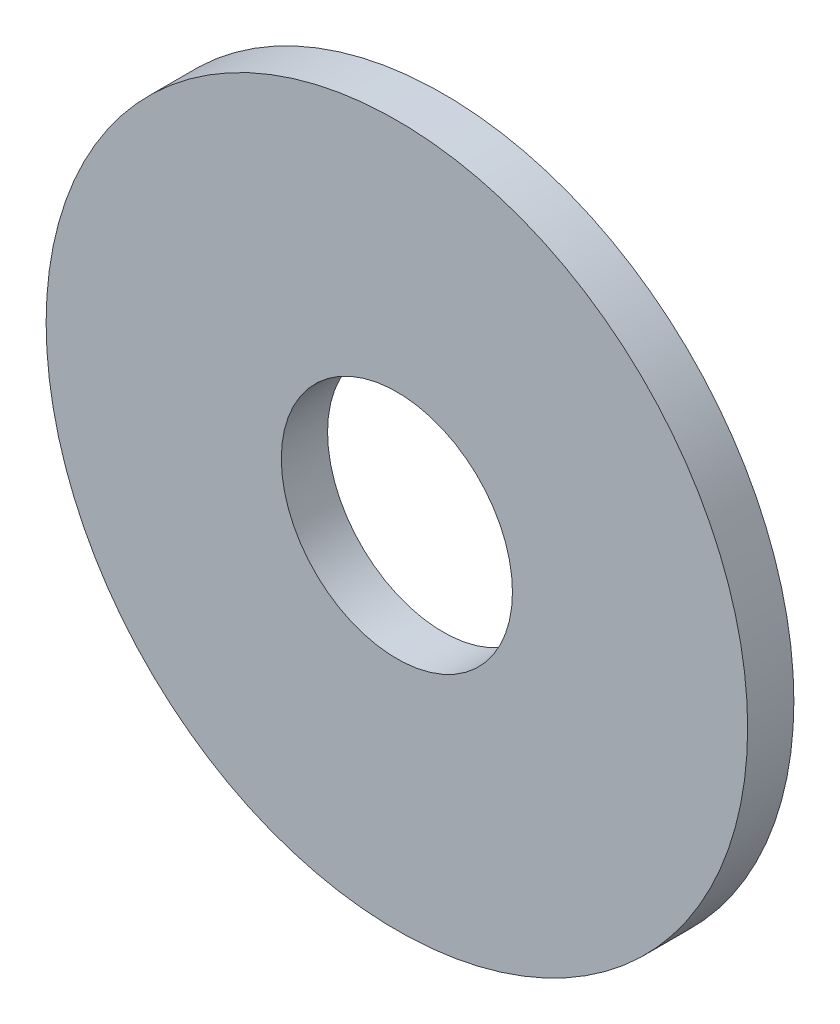
ISO-10303-21;
HEADER;
FILE_DESCRIPTION(('STEP AP214'),'2;1');
FILE_NAME('part.step','',(''),(''),'','','');
FILE_SCHEMA(('AUTOMOTIVE_DESIGN { 1 0 10303 214 1 1 1 1 }'));
ENDSEC;
DATA;
#1=APPLICATION_CONTEXT('core data for automotive mechanical design processes');
#2=APPLICATION_PROTOCOL_DEFINITION('international standard','automotive_design',2000,#1);
#3=PRODUCT_CONTEXT('',#1,'mechanical');
#4=PRODUCT('Part','Part','',(#3));
#5=PRODUCT_RELATED_PRODUCT_CATEGORY('part','',(#4));
#6=PRODUCT_DEFINITION_FORMATION('','',#4);
#7=PRODUCT_DEFINITION_CONTEXT('part definition',#1,'design');
#8=PRODUCT_DEFINITION('design','',#6,#7);
#9=PRODUCT_DEFINITION_SHAPE('','',#8);
#10=(LENGTH_UNIT() NAMED_UNIT(*) SI_UNIT(.MILLI.,.METRE.));
#11=(NAMED_UNIT(*) PLANE_ANGLE_UNIT() SI_UNIT($,.RADIAN.));
#12=(NAMED_UNIT(*) SI_UNIT($,.STERADIAN.) SOLID_ANGLE_UNIT());
#13=UNCERTAINTY_MEASURE_WITH_UNIT(LENGTH_MEASURE(1.E-05),#10,'distance_accuracy_value','');
#14=(GEOMETRIC_REPRESENTATION_CONTEXT(3) GLOBAL_UNCERTAINTY_ASSIGNED_CONTEXT((#13)) GLOBAL_UNIT_ASSIGNED_CONTEXT((#10,
#11,#12)) REPRESENTATION_CONTEXT('',''));
#15=CARTESIAN_POINT('',(0.,0.,0.));
#16=DIRECTION('',(0.,0.,1.));
#17=DIRECTION('',(1.,0.,0.));
#18=AXIS2_PLACEMENT_3D('',#15,#16,#17);
#19=CARTESIAN_POINT('',(0.,0.,1.));
#20=DIRECTION('',(0.,0.,1.));
#21=DIRECTION('',(1.,0.,0.));
#22=AXIS2_PLACEMENT_3D('',#19,#20,#21);
#23=PLANE('',#22);
#24=CARTESIAN_POINT('',(0.,0.,1.));
#25=DIRECTION('',(0.,0.,1.));
#26=DIRECTION('',(1.,0.,0.));
#27=AXIS2_PLACEMENT_3D('',#24,#25,#26);
#28=CIRCLE('',#27,7.5875);
#29=CARTESIAN_POINT('',(7.5875,0.,1.));
#30=VERTEX_POINT('',#29);
#31=EDGE_CURVE('E10',#30,#30,#28,.T.);
#32=ORIENTED_EDGE('',*,*,#31,.T.);
#33=EDGE_LOOP('',(#32));
#34=FACE_BOUND('',#33,.T.);
#35=CARTESIAN_POINT('',(0.,0.,1.));
#36=DIRECTION('',(0.,0.,1.));
#37=DIRECTION('',(1.,0.,0.));
#38=AXIS2_PLACEMENT_3D('',#35,#36,#37);
#39=CIRCLE('',#38,2.5);
#40=CARTESIAN_POINT('',(2.5,0.,1.));
#41=VERTEX_POINT('',#40);
#42=EDGE_CURVE('E45',#41,#41,#39,.T.);
#43=ORIENTED_EDGE('',*,*,#42,.F.);
#44=EDGE_LOOP('',(#43));
#45=FACE_BOUND('',#44,.T.);
#46=ADVANCED_FACE('F34',(#34,#45),#23,.T.);
#47=CARTESIAN_POINT('',(0.,0.,0.));
#48=DIRECTION('',(0.,0.,1.));
#49=DIRECTION('',(1.,0.,0.));
#50=AXIS2_PLACEMENT_3D('',#47,#48,#49);
#51=PLANE('',#50);
#52=CARTESIAN_POINT('',(0.,0.,0.));
#53=DIRECTION('',(0.,0.,1.));
#54=DIRECTION('',(1.,0.,0.));
#55=AXIS2_PLACEMENT_3D('',#52,#53,#54);
#56=CIRCLE('',#55,7.5875);
#57=CARTESIAN_POINT('',(7.5875,0.,0.));
#58=VERTEX_POINT('',#57);
#59=EDGE_CURVE('E38',#58,#58,#56,.T.);
#60=ORIENTED_EDGE('',*,*,#59,.F.);
#61=EDGE_LOOP('',(#60));
#62=FACE_BOUND('',#61,.T.);
#63=CARTESIAN_POINT('',(0.,0.,0.));
#64=DIRECTION('',(0.,0.,1.));
#65=DIRECTION('',(1.,0.,0.));
#66=AXIS2_PLACEMENT_3D('',#63,#64,#65);
#67=CIRCLE('',#66,2.5);
#68=CARTESIAN_POINT('',(2.5,0.,0.));
#69=VERTEX_POINT('',#68);
#70=EDGE_CURVE('E47',#69,#69,#67,.T.);
#71=ORIENTED_EDGE('',*,*,#70,.T.);
#72=EDGE_LOOP('',(#71));
#73=FACE_BOUND('',#72,.T.);
#74=ADVANCED_FACE('F57',(#62,#73),#51,.F.);
#75=CARTESIAN_POINT('',(0.,0.,1.));
#76=DIRECTION('',(0.,0.,-1.));
#77=DIRECTION('',(-1.,0.,0.));
#78=AXIS2_PLACEMENT_3D('',#75,#76,#77);
#79=CYLINDRICAL_SURFACE('',#78,7.5875);
#80=ORIENTED_EDGE('',*,*,#31,.F.);
#81=EDGE_LOOP('',(#80));
#82=FACE_BOUND('',#81,.T.);
#83=ORIENTED_EDGE('',*,*,#59,.T.);
#84=EDGE_LOOP('',(#83));
#85=FACE_BOUND('',#84,.T.);
#86=ADVANCED_FACE('F36',(#82,#85),#79,.T.);
#87=CARTESIAN_POINT('',(0.,0.,1.));
#88=DIRECTION('',(0.,0.,-1.));
#89=DIRECTION('',(-1.,0.,0.));
#90=AXIS2_PLACEMENT_3D('',#87,#88,#89);
#91=CYLINDRICAL_SURFACE('',#90,2.5);
#92=ORIENTED_EDGE('',*,*,#42,.T.);
#93=EDGE_LOOP('',(#92));
#94=FACE_BOUND('',#93,.T.);
#95=ORIENTED_EDGE('',*,*,#70,.F.);
#96=EDGE_LOOP('',(#95));
#97=FACE_BOUND('',#96,.T.);
#98=ADVANCED_FACE('F53',(#94,#97),#91,.F.);
#99=CLOSED_SHELL('',(#46,#74,#86,#98));
#100=MANIFOLD_SOLID_BREP('B2',#99);
#101=ADVANCED_BREP_SHAPE_REPRESENTATION('',(#18,#100),#14);
#102=SHAPE_DEFINITION_REPRESENTATION(#9,#101);
ENDSEC;
END-ISO-10303-21;
